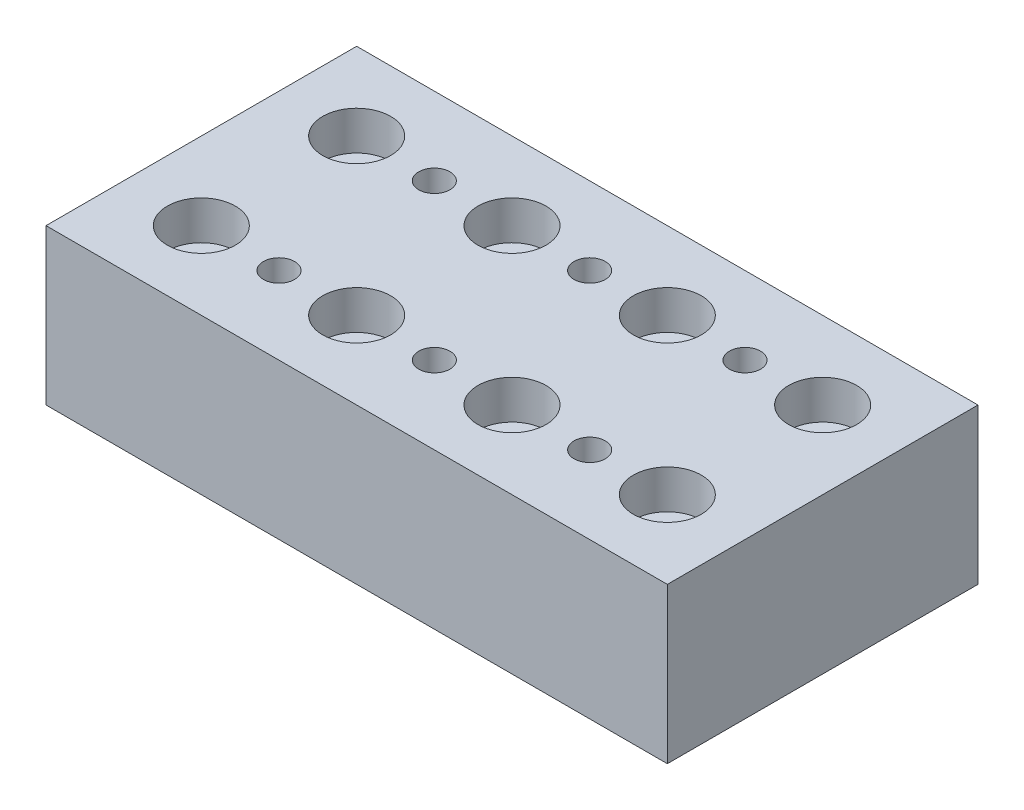
ISO-10303-21;
HEADER;
FILE_DESCRIPTION(('STEP AP214'),'2;1');
FILE_NAME('part.step','',(''),(''),'','','');
FILE_SCHEMA(('AUTOMOTIVE_DESIGN { 1 0 10303 214 1 1 1 1 }'));
ENDSEC;
DATA;
#1=APPLICATION_CONTEXT('core data for automotive mechanical design processes');
#2=APPLICATION_PROTOCOL_DEFINITION('international standard','automotive_design',2000,#1);
#3=PRODUCT_CONTEXT('',#1,'mechanical');
#4=PRODUCT('Part','Part','',(#3));
#5=PRODUCT_RELATED_PRODUCT_CATEGORY('part','',(#4));
#6=PRODUCT_DEFINITION_FORMATION('','',#4);
#7=PRODUCT_DEFINITION_CONTEXT('part definition',#1,'design');
#8=PRODUCT_DEFINITION('design','',#6,#7);
#9=PRODUCT_DEFINITION_SHAPE('','',#8);
#10=(LENGTH_UNIT() NAMED_UNIT(*) SI_UNIT(.MILLI.,.METRE.));
#11=(NAMED_UNIT(*) PLANE_ANGLE_UNIT() SI_UNIT($,.RADIAN.));
#12=(NAMED_UNIT(*) SI_UNIT($,.STERADIAN.) SOLID_ANGLE_UNIT());
#13=UNCERTAINTY_MEASURE_WITH_UNIT(LENGTH_MEASURE(1.E-05),#10,'distance_accuracy_value','');
#14=(GEOMETRIC_REPRESENTATION_CONTEXT(3) GLOBAL_UNCERTAINTY_ASSIGNED_CONTEXT((#13)) GLOBAL_UNIT_ASSIGNED_CONTEXT((#10,
#11,#12)) REPRESENTATION_CONTEXT('',''));
#15=CARTESIAN_POINT('',(0.,0.,0.));
#16=DIRECTION('',(0.,0.,1.));
#17=DIRECTION('',(1.,0.,0.));
#18=AXIS2_PLACEMENT_3D('',#15,#16,#17);
#19=CARTESIAN_POINT('',(0.,0.,-50.8));
#20=DIRECTION('',(0.,-1.,0.));
#21=DIRECTION('',(0.,0.,-1.));
#22=AXIS2_PLACEMENT_3D('',#19,#20,#21);
#23=PLANE('',#22);
#24=CARTESIAN_POINT('',(50.8,0.,-12.7));
#25=DIRECTION('',(0.,1.,0.));
#26=DIRECTION('',(0.,0.,1.));
#27=AXIS2_PLACEMENT_3D('',#24,#25,#26);
#28=CIRCLE('',#27,2.55269999999999);
#29=CARTESIAN_POINT('',(50.8,0.,-10.1473));
#30=VERTEX_POINT('',#29);
#31=EDGE_CURVE('E294',#30,#30,#28,.T.);
#32=ORIENTED_EDGE('',*,*,#31,.T.);
#33=EDGE_LOOP('',(#32));
#34=FACE_BOUND('',#33,.T.);
#35=CARTESIAN_POINT('',(76.2,0.,-38.1));
#36=DIRECTION('',(0.,1.,0.));
#37=DIRECTION('',(0.,0.,1.));
#38=AXIS2_PLACEMENT_3D('',#35,#36,#37);
#39=CIRCLE('',#38,2.55269999999999);
#40=CARTESIAN_POINT('',(76.2,0.,-35.5473));
#41=VERTEX_POINT('',#40);
#42=EDGE_CURVE('E307',#41,#41,#39,.T.);
#43=ORIENTED_EDGE('',*,*,#42,.T.);
#44=EDGE_LOOP('',(#43));
#45=FACE_BOUND('',#44,.T.);
#46=CARTESIAN_POINT('',(88.9,0.,-38.1));
#47=DIRECTION('',(0.,1.,0.));
#48=DIRECTION('',(0.,0.,1.));
#49=AXIS2_PLACEMENT_3D('',#46,#47,#48);
#50=CIRCLE('',#49,3.37819999999999);
#51=CARTESIAN_POINT('',(88.9,0.,-34.7218));
#52=VERTEX_POINT('',#51);
#53=EDGE_CURVE('E175',#52,#52,#50,.T.);
#54=ORIENTED_EDGE('',*,*,#53,.T.);
#55=EDGE_LOOP('',(#54));
#56=FACE_BOUND('',#55,.T.);
#57=CARTESIAN_POINT('',(88.9,0.,-12.7));
#58=DIRECTION('',(0.,1.,0.));
#59=DIRECTION('',(0.,0.,1.));
#60=AXIS2_PLACEMENT_3D('',#57,#58,#59);
#61=CIRCLE('',#60,3.37819999999999);
#62=CARTESIAN_POINT('',(88.9,0.,-9.3218));
#63=VERTEX_POINT('',#62);
#64=EDGE_CURVE('E163',#63,#63,#61,.T.);
#65=ORIENTED_EDGE('',*,*,#64,.T.);
#66=EDGE_LOOP('',(#65));
#67=FACE_BOUND('',#66,.T.);
#68=CARTESIAN_POINT('',(63.5,0.,-38.1));
#69=DIRECTION('',(0.,1.,0.));
#70=DIRECTION('',(0.,0.,1.));
#71=AXIS2_PLACEMENT_3D('',#68,#69,#70);
#72=CIRCLE('',#71,3.37819999999999);
#73=CARTESIAN_POINT('',(63.5,0.,-34.7218));
#74=VERTEX_POINT('',#73);
#75=EDGE_CURVE('E151',#74,#74,#72,.T.);
#76=ORIENTED_EDGE('',*,*,#75,.T.);
#77=EDGE_LOOP('',(#76));
#78=FACE_BOUND('',#77,.T.);
#79=CARTESIAN_POINT('',(63.5,0.,-12.7));
#80=DIRECTION('',(0.,1.,0.));
#81=DIRECTION('',(0.,0.,1.));
#82=AXIS2_PLACEMENT_3D('',#79,#80,#81);
#83=CIRCLE('',#82,3.37819999999999);
#84=CARTESIAN_POINT('',(63.5,0.,-9.3218));
#85=VERTEX_POINT('',#84);
#86=EDGE_CURVE('E139',#85,#85,#83,.T.);
#87=ORIENTED_EDGE('',*,*,#86,.T.);
#88=EDGE_LOOP('',(#87));
#89=FACE_BOUND('',#88,.T.);
#90=CARTESIAN_POINT('',(38.1,0.,-38.1));
#91=DIRECTION('',(0.,1.,0.));
#92=DIRECTION('',(0.,0.,1.));
#93=AXIS2_PLACEMENT_3D('',#90,#91,#92);
#94=CIRCLE('',#93,3.37819999999999);
#95=CARTESIAN_POINT('',(38.1,0.,-34.7218));
#96=VERTEX_POINT('',#95);
#97=EDGE_CURVE('E127',#96,#96,#94,.T.);
#98=ORIENTED_EDGE('',*,*,#97,.T.);
#99=EDGE_LOOP('',(#98));
#100=FACE_BOUND('',#99,.T.);
#101=CARTESIAN_POINT('',(38.1,0.,-12.7));
#102=DIRECTION('',(0.,1.,0.));
#103=DIRECTION('',(0.,0.,1.));
#104=AXIS2_PLACEMENT_3D('',#101,#102,#103);
#105=CIRCLE('',#104,3.37819999999999);
#106=CARTESIAN_POINT('',(38.1,0.,-9.3218));
#107=VERTEX_POINT('',#106);
#108=EDGE_CURVE('E115',#107,#107,#105,.T.);
#109=ORIENTED_EDGE('',*,*,#108,.T.);
#110=EDGE_LOOP('',(#109));
#111=FACE_BOUND('',#110,.T.);
#112=DIRECTION('',(0.,0.,1.));
#113=VECTOR('',#112,1.);
#114=CARTESIAN_POINT('',(0.,0.,0.));
#115=LINE('',#114,#113);
#116=CARTESIAN_POINT('',(0.,0.,-50.8));
#117=VERTEX_POINT('',#116);
#118=CARTESIAN_POINT('',(0.,0.,0.));
#119=VERTEX_POINT('',#118);
#120=EDGE_CURVE('E102',#117,#119,#115,.T.);
#121=ORIENTED_EDGE('',*,*,#120,.F.);
#122=DIRECTION('',(-1.,0.,0.));
#123=VECTOR('',#122,1.);
#124=CARTESIAN_POINT('',(0.,0.,-50.8));
#125=LINE('',#124,#123);
#126=CARTESIAN_POINT('',(101.6,0.,-50.8));
#127=VERTEX_POINT('',#126);
#128=EDGE_CURVE('E73',#127,#117,#125,.T.);
#129=ORIENTED_EDGE('',*,*,#128,.F.);
#130=DIRECTION('',(0.,0.,-1.));
#131=VECTOR('',#130,1.);
#132=CARTESIAN_POINT('',(101.6,0.,0.));
#133=LINE('',#132,#131);
#134=CARTESIAN_POINT('',(101.6,0.,0.));
#135=VERTEX_POINT('',#134);
#136=EDGE_CURVE('E67',#135,#127,#133,.T.);
#137=ORIENTED_EDGE('',*,*,#136,.F.);
#138=DIRECTION('',(1.,0.,0.));
#139=VECTOR('',#138,1.);
#140=CARTESIAN_POINT('',(0.,0.,0.));
#141=LINE('',#140,#139);
#142=EDGE_CURVE('E92',#119,#135,#141,.T.);
#143=ORIENTED_EDGE('',*,*,#142,.F.);
#144=EDGE_LOOP('',(#121,#129,#137,#143));
#145=FACE_BOUND('',#144,.T.);
#146=CARTESIAN_POINT('',(12.7,0.,-12.7));
#147=DIRECTION('',(0.,1.,0.));
#148=DIRECTION('',(0.,0.,1.));
#149=AXIS2_PLACEMENT_3D('',#146,#147,#148);
#150=CIRCLE('',#149,3.37819999999999);
#151=CARTESIAN_POINT('',(12.7,0.,-9.3218));
#152=VERTEX_POINT('',#151);
#153=EDGE_CURVE('E105',#152,#152,#150,.T.);
#154=ORIENTED_EDGE('',*,*,#153,.T.);
#155=EDGE_LOOP('',(#154));
#156=FACE_BOUND('',#155,.T.);
#157=CARTESIAN_POINT('',(12.7,0.,-38.1));
#158=DIRECTION('',(0.,1.,0.));
#159=DIRECTION('',(0.,0.,1.));
#160=AXIS2_PLACEMENT_3D('',#157,#158,#159);
#161=CIRCLE('',#160,3.37819999999999);
#162=CARTESIAN_POINT('',(12.7,0.,-34.7218));
#163=VERTEX_POINT('',#162);
#164=EDGE_CURVE('E273',#163,#163,#161,.T.);
#165=ORIENTED_EDGE('',*,*,#164,.T.);
#166=EDGE_LOOP('',(#165));
#167=FACE_BOUND('',#166,.T.);
#168=CARTESIAN_POINT('',(25.4,0.,-38.1));
#169=DIRECTION('',(0.,1.,0.));
#170=DIRECTION('',(0.,0.,1.));
#171=AXIS2_PLACEMENT_3D('',#168,#169,#170);
#172=CIRCLE('',#171,2.55269999999999);
#173=CARTESIAN_POINT('',(25.4,0.,-35.5473));
#174=VERTEX_POINT('',#173);
#175=EDGE_CURVE('E277',#174,#174,#172,.T.);
#176=ORIENTED_EDGE('',*,*,#175,.T.);
#177=EDGE_LOOP('',(#176));
#178=FACE_BOUND('',#177,.T.);
#179=CARTESIAN_POINT('',(50.8,0.,-38.1));
#180=DIRECTION('',(0.,1.,0.));
#181=DIRECTION('',(0.,0.,1.));
#182=AXIS2_PLACEMENT_3D('',#179,#180,#181);
#183=CIRCLE('',#182,2.55269999999999);
#184=CARTESIAN_POINT('',(50.8,0.,-35.5473));
#185=VERTEX_POINT('',#184);
#186=EDGE_CURVE('E281',#185,#185,#183,.T.);
#187=ORIENTED_EDGE('',*,*,#186,.T.);
#188=EDGE_LOOP('',(#187));
#189=FACE_BOUND('',#188,.T.);
#190=CARTESIAN_POINT('',(25.4,0.,-12.7));
#191=DIRECTION('',(0.,1.,0.));
#192=DIRECTION('',(0.,0.,1.));
#193=AXIS2_PLACEMENT_3D('',#190,#191,#192);
#194=CIRCLE('',#193,2.55269999999999);
#195=CARTESIAN_POINT('',(25.4,0.,-10.1473));
#196=VERTEX_POINT('',#195);
#197=EDGE_CURVE('E285',#196,#196,#194,.T.);
#198=ORIENTED_EDGE('',*,*,#197,.T.);
#199=EDGE_LOOP('',(#198));
#200=FACE_BOUND('',#199,.T.);
#201=CARTESIAN_POINT('',(76.2,0.,-12.7));
#202=DIRECTION('',(0.,1.,0.));
#203=DIRECTION('',(0.,0.,1.));
#204=AXIS2_PLACEMENT_3D('',#201,#202,#203);
#205=CIRCLE('',#204,2.55269999999999);
#206=CARTESIAN_POINT('',(76.2,0.,-10.1473));
#207=VERTEX_POINT('',#206);
#208=EDGE_CURVE('E288',#207,#207,#205,.T.);
#209=ORIENTED_EDGE('',*,*,#208,.T.);
#210=EDGE_LOOP('',(#209));
#211=FACE_BOUND('',#210,.T.);
#212=ADVANCED_FACE('F33',(#34,#45,#56,#67,#78,#89,#100,#111,#145,#156,#167,#178,#189,#200,#211),
#23,.T.);
#213=CARTESIAN_POINT('',(0.,25.4,-50.8));
#214=DIRECTION('',(0.,-1.,0.));
#215=DIRECTION('',(0.,0.,-1.));
#216=AXIS2_PLACEMENT_3D('',#213,#214,#215);
#217=PLANE('',#216);
#218=CARTESIAN_POINT('',(50.8,25.4,-12.7));
#219=DIRECTION('',(0.,1.,0.));
#220=DIRECTION('',(0.,0.,1.));
#221=AXIS2_PLACEMENT_3D('',#218,#219,#220);
#222=CIRCLE('',#221,2.55269999999999);
#223=CARTESIAN_POINT('',(50.8,25.4,-10.1473));
#224=VERTEX_POINT('',#223);
#225=EDGE_CURVE('E290',#224,#224,#222,.T.);
#226=ORIENTED_EDGE('',*,*,#225,.F.);
#227=EDGE_LOOP('',(#226));
#228=FACE_BOUND('',#227,.T.);
#229=CARTESIAN_POINT('',(76.2,25.4,-38.1));
#230=DIRECTION('',(0.,1.,0.));
#231=DIRECTION('',(0.,0.,1.));
#232=AXIS2_PLACEMENT_3D('',#229,#230,#231);
#233=CIRCLE('',#232,2.55269999999999);
#234=CARTESIAN_POINT('',(76.2,25.4,-35.5473));
#235=VERTEX_POINT('',#234);
#236=EDGE_CURVE('E304',#235,#235,#233,.T.);
#237=ORIENTED_EDGE('',*,*,#236,.F.);
#238=EDGE_LOOP('',(#237));
#239=FACE_BOUND('',#238,.T.);
#240=CARTESIAN_POINT('',(88.9,25.4,-38.1));
#241=DIRECTION('',(0.,1.,0.));
#242=DIRECTION('',(0.,0.,1.));
#243=AXIS2_PLACEMENT_3D('',#240,#241,#242);
#244=CIRCLE('',#243,5.55625);
#245=CARTESIAN_POINT('',(88.9,25.4,-32.54375));
#246=VERTEX_POINT('',#245);
#247=EDGE_CURVE('E172',#246,#246,#244,.T.);
#248=ORIENTED_EDGE('',*,*,#247,.F.);
#249=EDGE_LOOP('',(#248));
#250=FACE_BOUND('',#249,.T.);
#251=CARTESIAN_POINT('',(88.9,25.4,-12.7));
#252=DIRECTION('',(0.,1.,0.));
#253=DIRECTION('',(0.,0.,1.));
#254=AXIS2_PLACEMENT_3D('',#251,#252,#253);
#255=CIRCLE('',#254,5.55625);
#256=CARTESIAN_POINT('',(88.9,25.4,-7.14374999999999));
#257=VERTEX_POINT('',#256);
#258=EDGE_CURVE('E160',#257,#257,#255,.T.);
#259=ORIENTED_EDGE('',*,*,#258,.F.);
#260=EDGE_LOOP('',(#259));
#261=FACE_BOUND('',#260,.T.);
#262=CARTESIAN_POINT('',(63.5,25.4,-38.1));
#263=DIRECTION('',(0.,1.,0.));
#264=DIRECTION('',(0.,0.,1.));
#265=AXIS2_PLACEMENT_3D('',#262,#263,#264);
#266=CIRCLE('',#265,5.55625);
#267=CARTESIAN_POINT('',(63.5,25.4,-32.54375));
#268=VERTEX_POINT('',#267);
#269=EDGE_CURVE('E148',#268,#268,#266,.T.);
#270=ORIENTED_EDGE('',*,*,#269,.F.);
#271=EDGE_LOOP('',(#270));
#272=FACE_BOUND('',#271,.T.);
#273=CARTESIAN_POINT('',(63.5,25.4,-12.7));
#274=DIRECTION('',(0.,1.,0.));
#275=DIRECTION('',(0.,0.,1.));
#276=AXIS2_PLACEMENT_3D('',#273,#274,#275);
#277=CIRCLE('',#276,5.55625);
#278=CARTESIAN_POINT('',(63.5,25.4,-7.14374999999999));
#279=VERTEX_POINT('',#278);
#280=EDGE_CURVE('E136',#279,#279,#277,.T.);
#281=ORIENTED_EDGE('',*,*,#280,.F.);
#282=EDGE_LOOP('',(#281));
#283=FACE_BOUND('',#282,.T.);
#284=CARTESIAN_POINT('',(38.1,25.4,-38.1));
#285=DIRECTION('',(0.,1.,0.));
#286=DIRECTION('',(0.,0.,1.));
#287=AXIS2_PLACEMENT_3D('',#284,#285,#286);
#288=CIRCLE('',#287,5.55625);
#289=CARTESIAN_POINT('',(38.1,25.4,-32.54375));
#290=VERTEX_POINT('',#289);
#291=EDGE_CURVE('E124',#290,#290,#288,.T.);
#292=ORIENTED_EDGE('',*,*,#291,.F.);
#293=EDGE_LOOP('',(#292));
#294=FACE_BOUND('',#293,.T.);
#295=CARTESIAN_POINT('',(38.1,25.4,-12.7));
#296=DIRECTION('',(0.,1.,0.));
#297=DIRECTION('',(0.,0.,1.));
#298=AXIS2_PLACEMENT_3D('',#295,#296,#297);
#299=CIRCLE('',#298,5.55625);
#300=CARTESIAN_POINT('',(38.1,25.4,-7.14374999999999));
#301=VERTEX_POINT('',#300);
#302=EDGE_CURVE('E112',#301,#301,#299,.T.);
#303=ORIENTED_EDGE('',*,*,#302,.F.);
#304=EDGE_LOOP('',(#303));
#305=FACE_BOUND('',#304,.T.);
#306=DIRECTION('',(0.,0.,1.));
#307=VECTOR('',#306,1.);
#308=CARTESIAN_POINT('',(0.,25.4,0.));
#309=LINE('',#308,#307);
#310=CARTESIAN_POINT('',(0.,25.4,-50.8));
#311=VERTEX_POINT('',#310);
#312=CARTESIAN_POINT('',(0.,25.4,0.));
#313=VERTEX_POINT('',#312);
#314=EDGE_CURVE('E87',#311,#313,#309,.T.);
#315=ORIENTED_EDGE('',*,*,#314,.T.);
#316=DIRECTION('',(1.,0.,0.));
#317=VECTOR('',#316,1.);
#318=CARTESIAN_POINT('',(0.,25.4,0.));
#319=LINE('',#318,#317);
#320=CARTESIAN_POINT('',(101.6,25.4,0.));
#321=VERTEX_POINT('',#320);
#322=EDGE_CURVE('E81',#313,#321,#319,.T.);
#323=ORIENTED_EDGE('',*,*,#322,.T.);
#324=DIRECTION('',(0.,0.,-1.));
#325=VECTOR('',#324,1.);
#326=CARTESIAN_POINT('',(101.6,25.4,0.));
#327=LINE('',#326,#325);
#328=CARTESIAN_POINT('',(101.6,25.4,-50.8));
#329=VERTEX_POINT('',#328);
#330=EDGE_CURVE('E85',#321,#329,#327,.T.);
#331=ORIENTED_EDGE('',*,*,#330,.T.);
#332=DIRECTION('',(-1.,0.,0.));
#333=VECTOR('',#332,1.);
#334=CARTESIAN_POINT('',(0.,25.4,-50.8));
#335=LINE('',#334,#333);
#336=EDGE_CURVE('E50',#329,#311,#335,.T.);
#337=ORIENTED_EDGE('',*,*,#336,.T.);
#338=EDGE_LOOP('',(#315,#323,#331,#337));
#339=FACE_BOUND('',#338,.T.);
#340=CARTESIAN_POINT('',(12.7,25.4,-12.7));
#341=DIRECTION('',(0.,1.,0.));
#342=DIRECTION('',(0.,0.,1.));
#343=AXIS2_PLACEMENT_3D('',#340,#341,#342);
#344=CIRCLE('',#343,5.55625);
#345=CARTESIAN_POINT('',(12.7,25.4,-7.14375));
#346=VERTEX_POINT('',#345);
#347=EDGE_CURVE('E328',#346,#346,#344,.T.);
#348=ORIENTED_EDGE('',*,*,#347,.F.);
#349=EDGE_LOOP('',(#348));
#350=FACE_BOUND('',#349,.T.);
#351=CARTESIAN_POINT('',(12.7,25.4,-38.1));
#352=DIRECTION('',(0.,1.,0.));
#353=DIRECTION('',(0.,0.,1.));
#354=AXIS2_PLACEMENT_3D('',#351,#352,#353);
#355=CIRCLE('',#354,5.55625);
#356=CARTESIAN_POINT('',(12.7,25.4,-32.54375));
#357=VERTEX_POINT('',#356);
#358=EDGE_CURVE('E318',#357,#357,#355,.T.);
#359=ORIENTED_EDGE('',*,*,#358,.F.);
#360=EDGE_LOOP('',(#359));
#361=FACE_BOUND('',#360,.T.);
#362=CARTESIAN_POINT('',(25.4,25.4,-38.1));
#363=DIRECTION('',(0.,1.,0.));
#364=DIRECTION('',(0.,0.,1.));
#365=AXIS2_PLACEMENT_3D('',#362,#363,#364);
#366=CIRCLE('',#365,2.55269999999999);
#367=CARTESIAN_POINT('',(25.4,25.4,-35.5473));
#368=VERTEX_POINT('',#367);
#369=EDGE_CURVE('E314',#368,#368,#366,.T.);
#370=ORIENTED_EDGE('',*,*,#369,.F.);
#371=EDGE_LOOP('',(#370));
#372=FACE_BOUND('',#371,.T.);
#373=CARTESIAN_POINT('',(50.8,25.4,-38.1));
#374=DIRECTION('',(0.,1.,0.));
#375=DIRECTION('',(0.,0.,1.));
#376=AXIS2_PLACEMENT_3D('',#373,#374,#375);
#377=CIRCLE('',#376,2.55269999999999);
#378=CARTESIAN_POINT('',(50.8,25.4,-35.5473));
#379=VERTEX_POINT('',#378);
#380=EDGE_CURVE('E310',#379,#379,#377,.T.);
#381=ORIENTED_EDGE('',*,*,#380,.F.);
#382=EDGE_LOOP('',(#381));
#383=FACE_BOUND('',#382,.T.);
#384=CARTESIAN_POINT('',(25.4,25.4,-12.7));
#385=DIRECTION('',(0.,1.,0.));
#386=DIRECTION('',(0.,0.,1.));
#387=AXIS2_PLACEMENT_3D('',#384,#385,#386);
#388=CIRCLE('',#387,2.55269999999999);
#389=CARTESIAN_POINT('',(25.4,25.4,-10.1473));
#390=VERTEX_POINT('',#389);
#391=EDGE_CURVE('E300',#390,#390,#388,.T.);
#392=ORIENTED_EDGE('',*,*,#391,.F.);
#393=EDGE_LOOP('',(#392));
#394=FACE_BOUND('',#393,.T.);
#395=CARTESIAN_POINT('',(76.2,25.4,-12.7));
#396=DIRECTION('',(0.,1.,0.));
#397=DIRECTION('',(0.,0.,1.));
#398=AXIS2_PLACEMENT_3D('',#395,#396,#397);
#399=CIRCLE('',#398,2.55269999999999);
#400=CARTESIAN_POINT('',(76.2,25.4,-10.1473));
#401=VERTEX_POINT('',#400);
#402=EDGE_CURVE('E291',#401,#401,#399,.T.);
#403=ORIENTED_EDGE('',*,*,#402,.F.);
#404=EDGE_LOOP('',(#403));
#405=FACE_BOUND('',#404,.T.);
#406=ADVANCED_FACE('F82',(#228,#239,#250,#261,#272,#283,#294,#305,#339,#350,#361,#372,#383,#394,
#405),#217,.F.);
#407=CARTESIAN_POINT('',(0.,25.4,0.));
#408=DIRECTION('',(1.,0.,0.));
#409=DIRECTION('',(0.,0.,-1.));
#410=AXIS2_PLACEMENT_3D('',#407,#408,#409);
#411=PLANE('',#410);
#412=ORIENTED_EDGE('',*,*,#120,.T.);
#413=DIRECTION('',(0.,-1.,0.));
#414=VECTOR('',#413,1.);
#415=CARTESIAN_POINT('',(0.,25.4,0.));
#416=LINE('',#415,#414);
#417=EDGE_CURVE('E93',#313,#119,#416,.T.);
#418=ORIENTED_EDGE('',*,*,#417,.F.);
#419=ORIENTED_EDGE('',*,*,#314,.F.);
#420=DIRECTION('',(0.,-1.,0.));
#421=VECTOR('',#420,1.);
#422=CARTESIAN_POINT('',(0.,25.4,-50.8));
#423=LINE('',#422,#421);
#424=EDGE_CURVE('E98',#311,#117,#423,.T.);
#425=ORIENTED_EDGE('',*,*,#424,.T.);
#426=EDGE_LOOP('',(#412,#418,#419,#425));
#427=FACE_BOUND('',#426,.T.);
#428=ADVANCED_FACE('F194',(#427),#411,.F.);
#429=CARTESIAN_POINT('',(0.,25.4,0.));
#430=DIRECTION('',(0.,0.,-1.));
#431=DIRECTION('',(-1.,0.,0.));
#432=AXIS2_PLACEMENT_3D('',#429,#430,#431);
#433=PLANE('',#432);
#434=ORIENTED_EDGE('',*,*,#142,.T.);
#435=DIRECTION('',(0.,-1.,0.));
#436=VECTOR('',#435,1.);
#437=CARTESIAN_POINT('',(101.6,25.4,0.));
#438=LINE('',#437,#436);
#439=EDGE_CURVE('E90',#321,#135,#438,.T.);
#440=ORIENTED_EDGE('',*,*,#439,.F.);
#441=ORIENTED_EDGE('',*,*,#322,.F.);
#442=ORIENTED_EDGE('',*,*,#417,.T.);
#443=EDGE_LOOP('',(#434,#440,#441,#442));
#444=FACE_BOUND('',#443,.T.);
#445=ADVANCED_FACE('F91',(#444),#433,.F.);
#446=CARTESIAN_POINT('',(101.6,25.4,0.));
#447=DIRECTION('',(-1.,0.,0.));
#448=DIRECTION('',(0.,0.,1.));
#449=AXIS2_PLACEMENT_3D('',#446,#447,#448);
#450=PLANE('',#449);
#451=ORIENTED_EDGE('',*,*,#136,.T.);
#452=DIRECTION('',(0.,-1.,0.));
#453=VECTOR('',#452,1.);
#454=CARTESIAN_POINT('',(101.6,25.4,-50.8));
#455=LINE('',#454,#453);
#456=EDGE_CURVE('E94',#329,#127,#455,.T.);
#457=ORIENTED_EDGE('',*,*,#456,.F.);
#458=ORIENTED_EDGE('',*,*,#330,.F.);
#459=ORIENTED_EDGE('',*,*,#439,.T.);
#460=EDGE_LOOP('',(#451,#457,#458,#459));
#461=FACE_BOUND('',#460,.T.);
#462=ADVANCED_FACE('F96',(#461),#450,.F.);
#463=CARTESIAN_POINT('',(0.,25.4,-50.8));
#464=DIRECTION('',(0.,0.,1.));
#465=DIRECTION('',(1.,0.,0.));
#466=AXIS2_PLACEMENT_3D('',#463,#464,#465);
#467=PLANE('',#466);
#468=ORIENTED_EDGE('',*,*,#128,.T.);
#469=ORIENTED_EDGE('',*,*,#424,.F.);
#470=ORIENTED_EDGE('',*,*,#336,.F.);
#471=ORIENTED_EDGE('',*,*,#456,.T.);
#472=EDGE_LOOP('',(#468,#469,#470,#471));
#473=FACE_BOUND('',#472,.T.);
#474=ADVANCED_FACE('F239',(#473),#467,.F.);
#475=CARTESIAN_POINT('',(12.7,25.4,-12.7));
#476=DIRECTION('',(0.,1.,0.));
#477=DIRECTION('',(0.,0.,1.));
#478=AXIS2_PLACEMENT_3D('',#475,#476,#477);
#479=CYLINDRICAL_SURFACE('',#478,3.3782);
#480=ORIENTED_EDGE('',*,*,#153,.F.);
#481=EDGE_LOOP('',(#480));
#482=FACE_BOUND('',#481,.T.);
#483=CARTESIAN_POINT('',(12.7,19.05,-12.7));
#484=DIRECTION('',(0.,1.,0.));
#485=DIRECTION('',(0.,0.,1.));
#486=AXIS2_PLACEMENT_3D('',#483,#484,#485);
#487=CIRCLE('',#486,3.3782);
#488=CARTESIAN_POINT('',(12.7,19.05,-9.3218));
#489=VERTEX_POINT('',#488);
#490=EDGE_CURVE('E334',#489,#489,#487,.T.);
#491=ORIENTED_EDGE('',*,*,#490,.T.);
#492=EDGE_LOOP('',(#491));
#493=FACE_BOUND('',#492,.T.);
#494=ADVANCED_FACE('F242',(#482,#493),#479,.F.);
#495=CARTESIAN_POINT('',(16.0782,19.05,-12.7));
#496=DIRECTION('',(0.,-1.,0.));
#497=DIRECTION('',(0.,0.,-1.));
#498=AXIS2_PLACEMENT_3D('',#495,#496,#497);
#499=PLANE('',#498);
#500=ORIENTED_EDGE('',*,*,#490,.F.);
#501=EDGE_LOOP('',(#500));
#502=FACE_BOUND('',#501,.T.);
#503=CARTESIAN_POINT('',(12.7,19.05,-12.7));
#504=DIRECTION('',(0.,1.,0.));
#505=DIRECTION('',(0.,0.,1.));
#506=AXIS2_PLACEMENT_3D('',#503,#504,#505);
#507=CIRCLE('',#506,5.55625);
#508=CARTESIAN_POINT('',(12.7,19.05,-7.14375));
#509=VERTEX_POINT('',#508);
#510=EDGE_CURVE('E331',#509,#509,#507,.T.);
#511=ORIENTED_EDGE('',*,*,#510,.T.);
#512=EDGE_LOOP('',(#511));
#513=FACE_BOUND('',#512,.T.);
#514=ADVANCED_FACE('F340',(#502,#513),#499,.F.);
#515=CARTESIAN_POINT('',(12.7,25.4,-12.7));
#516=DIRECTION('',(0.,1.,0.));
#517=DIRECTION('',(0.,0.,1.));
#518=AXIS2_PLACEMENT_3D('',#515,#516,#517);
#519=CYLINDRICAL_SURFACE('',#518,5.55625);
#520=ORIENTED_EDGE('',*,*,#510,.F.);
#521=EDGE_LOOP('',(#520));
#522=FACE_BOUND('',#521,.T.);
#523=ORIENTED_EDGE('',*,*,#347,.T.);
#524=EDGE_LOOP('',(#523));
#525=FACE_BOUND('',#524,.T.);
#526=ADVANCED_FACE('F224',(#522,#525),#519,.F.);
#527=CARTESIAN_POINT('',(12.7,25.4,-38.1));
#528=DIRECTION('',(0.,1.,0.));
#529=DIRECTION('',(0.,0.,1.));
#530=AXIS2_PLACEMENT_3D('',#527,#528,#529);
#531=CYLINDRICAL_SURFACE('',#530,3.3782);
#532=ORIENTED_EDGE('',*,*,#164,.F.);
#533=EDGE_LOOP('',(#532));
#534=FACE_BOUND('',#533,.T.);
#535=CARTESIAN_POINT('',(12.7,19.05,-38.1));
#536=DIRECTION('',(0.,1.,0.));
#537=DIRECTION('',(0.,0.,1.));
#538=AXIS2_PLACEMENT_3D('',#535,#536,#537);
#539=CIRCLE('',#538,3.3782);
#540=CARTESIAN_POINT('',(12.7,19.05,-34.7218));
#541=VERTEX_POINT('',#540);
#542=EDGE_CURVE('E325',#541,#541,#539,.T.);
#543=ORIENTED_EDGE('',*,*,#542,.T.);
#544=EDGE_LOOP('',(#543));
#545=FACE_BOUND('',#544,.T.);
#546=ADVANCED_FACE('F213',(#534,#545),#531,.F.);
#547=CARTESIAN_POINT('',(16.0782,19.05,-38.1));
#548=DIRECTION('',(0.,-1.,0.));
#549=DIRECTION('',(0.,0.,-1.));
#550=AXIS2_PLACEMENT_3D('',#547,#548,#549);
#551=PLANE('',#550);
#552=ORIENTED_EDGE('',*,*,#542,.F.);
#553=EDGE_LOOP('',(#552));
#554=FACE_BOUND('',#553,.T.);
#555=CARTESIAN_POINT('',(12.7,19.05,-38.1));
#556=DIRECTION('',(0.,1.,0.));
#557=DIRECTION('',(0.,0.,1.));
#558=AXIS2_PLACEMENT_3D('',#555,#556,#557);
#559=CIRCLE('',#558,5.55625);
#560=CARTESIAN_POINT('',(12.7,19.05,-32.54375));
#561=VERTEX_POINT('',#560);
#562=EDGE_CURVE('E322',#561,#561,#559,.T.);
#563=ORIENTED_EDGE('',*,*,#562,.T.);
#564=EDGE_LOOP('',(#563));
#565=FACE_BOUND('',#564,.T.);
#566=ADVANCED_FACE('F221',(#554,#565),#551,.F.);
#567=CARTESIAN_POINT('',(12.7,25.4,-38.1));
#568=DIRECTION('',(0.,1.,0.));
#569=DIRECTION('',(0.,0.,1.));
#570=AXIS2_PLACEMENT_3D('',#567,#568,#569);
#571=CYLINDRICAL_SURFACE('',#570,5.55625);
#572=ORIENTED_EDGE('',*,*,#562,.F.);
#573=EDGE_LOOP('',(#572));
#574=FACE_BOUND('',#573,.T.);
#575=ORIENTED_EDGE('',*,*,#358,.T.);
#576=EDGE_LOOP('',(#575));
#577=FACE_BOUND('',#576,.T.);
#578=ADVANCED_FACE('F210',(#574,#577),#571,.F.);
#579=CARTESIAN_POINT('',(38.1,25.4,-12.7));
#580=DIRECTION('',(0.,1.,0.));
#581=DIRECTION('',(0.,0.,1.));
#582=AXIS2_PLACEMENT_3D('',#579,#580,#581);
#583=CYLINDRICAL_SURFACE('',#582,5.55625);
#584=CARTESIAN_POINT('',(38.1,19.05,-12.7));
#585=DIRECTION('',(0.,1.,0.));
#586=DIRECTION('',(0.,0.,1.));
#587=AXIS2_PLACEMENT_3D('',#584,#585,#586);
#588=CIRCLE('',#587,5.55625);
#589=CARTESIAN_POINT('',(38.1,19.05,-7.14375));
#590=VERTEX_POINT('',#589);
#591=EDGE_CURVE('E121',#590,#590,#588,.T.);
#592=ORIENTED_EDGE('',*,*,#591,.F.);
#593=EDGE_LOOP('',(#592));
#594=FACE_BOUND('',#593,.T.);
#595=ORIENTED_EDGE('',*,*,#302,.T.);
#596=EDGE_LOOP('',(#595));
#597=FACE_BOUND('',#596,.T.);
#598=ADVANCED_FACE('F207',(#594,#597),#583,.F.);
#599=CARTESIAN_POINT('',(41.4782,19.05,-12.7));
#600=DIRECTION('',(0.,-1.,0.));
#601=DIRECTION('',(0.,0.,-1.));
#602=AXIS2_PLACEMENT_3D('',#599,#600,#601);
#603=PLANE('',#602);
#604=CARTESIAN_POINT('',(38.1,19.05,-12.7));
#605=DIRECTION('',(0.,1.,0.));
#606=DIRECTION('',(0.,0.,1.));
#607=AXIS2_PLACEMENT_3D('',#604,#605,#606);
#608=CIRCLE('',#607,3.3782);
#609=CARTESIAN_POINT('',(38.1,19.05,-9.32179999999999));
#610=VERTEX_POINT('',#609);
#611=EDGE_CURVE('E118',#610,#610,#608,.T.);
#612=ORIENTED_EDGE('',*,*,#611,.F.);
#613=EDGE_LOOP('',(#612));
#614=FACE_BOUND('',#613,.T.);
#615=ORIENTED_EDGE('',*,*,#591,.T.);
#616=EDGE_LOOP('',(#615));
#617=FACE_BOUND('',#616,.T.);
#618=ADVANCED_FACE('F209',(#614,#617),#603,.F.);
#619=CARTESIAN_POINT('',(38.1,25.4,-12.7));
#620=DIRECTION('',(0.,1.,0.));
#621=DIRECTION('',(0.,0.,1.));
#622=AXIS2_PLACEMENT_3D('',#619,#620,#621);
#623=CYLINDRICAL_SURFACE('',#622,3.3782);
#624=ORIENTED_EDGE('',*,*,#108,.F.);
#625=EDGE_LOOP('',(#624));
#626=FACE_BOUND('',#625,.T.);
#627=ORIENTED_EDGE('',*,*,#611,.T.);
#628=EDGE_LOOP('',(#627));
#629=FACE_BOUND('',#628,.T.);
#630=ADVANCED_FACE('F218',(#626,#629),#623,.F.);
#631=CARTESIAN_POINT('',(38.1,25.4,-38.1));
#632=DIRECTION('',(0.,1.,0.));
#633=DIRECTION('',(0.,0.,1.));
#634=AXIS2_PLACEMENT_3D('',#631,#632,#633);
#635=CYLINDRICAL_SURFACE('',#634,5.55625);
#636=CARTESIAN_POINT('',(38.1,19.05,-38.1));
#637=DIRECTION('',(0.,1.,0.));
#638=DIRECTION('',(0.,0.,1.));
#639=AXIS2_PLACEMENT_3D('',#636,#637,#638);
#640=CIRCLE('',#639,5.55625);
#641=CARTESIAN_POINT('',(38.1,19.05,-32.54375));
#642=VERTEX_POINT('',#641);
#643=EDGE_CURVE('E133',#642,#642,#640,.T.);
#644=ORIENTED_EDGE('',*,*,#643,.F.);
#645=EDGE_LOOP('',(#644));
#646=FACE_BOUND('',#645,.T.);
#647=ORIENTED_EDGE('',*,*,#291,.T.);
#648=EDGE_LOOP('',(#647));
#649=FACE_BOUND('',#648,.T.);
#650=ADVANCED_FACE('F251',(#646,#649),#635,.F.);
#651=CARTESIAN_POINT('',(41.4782,19.05,-38.1));
#652=DIRECTION('',(0.,-1.,0.));
#653=DIRECTION('',(0.,0.,-1.));
#654=AXIS2_PLACEMENT_3D('',#651,#652,#653);
#655=PLANE('',#654);
#656=CARTESIAN_POINT('',(38.1,19.05,-38.1));
#657=DIRECTION('',(0.,1.,0.));
#658=DIRECTION('',(0.,0.,1.));
#659=AXIS2_PLACEMENT_3D('',#656,#657,#658);
#660=CIRCLE('',#659,3.3782);
#661=CARTESIAN_POINT('',(38.1,19.05,-34.7218));
#662=VERTEX_POINT('',#661);
#663=EDGE_CURVE('E130',#662,#662,#660,.T.);
#664=ORIENTED_EDGE('',*,*,#663,.F.);
#665=EDGE_LOOP('',(#664));
#666=FACE_BOUND('',#665,.T.);
#667=ORIENTED_EDGE('',*,*,#643,.T.);
#668=EDGE_LOOP('',(#667));
#669=FACE_BOUND('',#668,.T.);
#670=ADVANCED_FACE('F256',(#666,#669),#655,.F.);
#671=CARTESIAN_POINT('',(38.1,25.4,-38.1));
#672=DIRECTION('',(0.,1.,0.));
#673=DIRECTION('',(0.,0.,1.));
#674=AXIS2_PLACEMENT_3D('',#671,#672,#673);
#675=CYLINDRICAL_SURFACE('',#674,3.3782);
#676=ORIENTED_EDGE('',*,*,#97,.F.);
#677=EDGE_LOOP('',(#676));
#678=FACE_BOUND('',#677,.T.);
#679=ORIENTED_EDGE('',*,*,#663,.T.);
#680=EDGE_LOOP('',(#679));
#681=FACE_BOUND('',#680,.T.);
#682=ADVANCED_FACE('F444',(#678,#681),#675,.F.);
#683=CARTESIAN_POINT('',(63.5,25.4,-12.7));
#684=DIRECTION('',(0.,1.,0.));
#685=DIRECTION('',(0.,0.,1.));
#686=AXIS2_PLACEMENT_3D('',#683,#684,#685);
#687=CYLINDRICAL_SURFACE('',#686,5.55625);
#688=CARTESIAN_POINT('',(63.5,19.05,-12.7));
#689=DIRECTION('',(0.,1.,0.));
#690=DIRECTION('',(0.,0.,1.));
#691=AXIS2_PLACEMENT_3D('',#688,#689,#690);
#692=CIRCLE('',#691,5.55625);
#693=CARTESIAN_POINT('',(63.5,19.05,-7.14375));
#694=VERTEX_POINT('',#693);
#695=EDGE_CURVE('E145',#694,#694,#692,.T.);
#696=ORIENTED_EDGE('',*,*,#695,.F.);
#697=EDGE_LOOP('',(#696));
#698=FACE_BOUND('',#697,.T.);
#699=ORIENTED_EDGE('',*,*,#280,.T.);
#700=EDGE_LOOP('',(#699));
#701=FACE_BOUND('',#700,.T.);
#702=ADVANCED_FACE('F454',(#698,#701),#687,.F.);
#703=CARTESIAN_POINT('',(66.8782,19.05,-12.7));
#704=DIRECTION('',(0.,-1.,0.));
#705=DIRECTION('',(0.,0.,-1.));
#706=AXIS2_PLACEMENT_3D('',#703,#704,#705);
#707=PLANE('',#706);
#708=CARTESIAN_POINT('',(63.5,19.05,-12.7));
#709=DIRECTION('',(0.,1.,0.));
#710=DIRECTION('',(0.,0.,1.));
#711=AXIS2_PLACEMENT_3D('',#708,#709,#710);
#712=CIRCLE('',#711,3.3782);
#713=CARTESIAN_POINT('',(63.5,19.05,-9.32179999999999));
#714=VERTEX_POINT('',#713);
#715=EDGE_CURVE('E142',#714,#714,#712,.T.);
#716=ORIENTED_EDGE('',*,*,#715,.F.);
#717=EDGE_LOOP('',(#716));
#718=FACE_BOUND('',#717,.T.);
#719=ORIENTED_EDGE('',*,*,#695,.T.);
#720=EDGE_LOOP('',(#719));
#721=FACE_BOUND('',#720,.T.);
#722=ADVANCED_FACE('F463',(#718,#721),#707,.F.);
#723=CARTESIAN_POINT('',(63.5,25.4,-12.7));
#724=DIRECTION('',(0.,1.,0.));
#725=DIRECTION('',(0.,0.,1.));
#726=AXIS2_PLACEMENT_3D('',#723,#724,#725);
#727=CYLINDRICAL_SURFACE('',#726,3.3782);
#728=ORIENTED_EDGE('',*,*,#86,.F.);
#729=EDGE_LOOP('',(#728));
#730=FACE_BOUND('',#729,.T.);
#731=ORIENTED_EDGE('',*,*,#715,.T.);
#732=EDGE_LOOP('',(#731));
#733=FACE_BOUND('',#732,.T.);
#734=ADVANCED_FACE('F473',(#730,#733),#727,.F.);
#735=CARTESIAN_POINT('',(63.5,25.4,-38.1));
#736=DIRECTION('',(0.,1.,0.));
#737=DIRECTION('',(0.,0.,1.));
#738=AXIS2_PLACEMENT_3D('',#735,#736,#737);
#739=CYLINDRICAL_SURFACE('',#738,5.55625);
#740=CARTESIAN_POINT('',(63.5,19.05,-38.1));
#741=DIRECTION('',(0.,1.,0.));
#742=DIRECTION('',(0.,0.,1.));
#743=AXIS2_PLACEMENT_3D('',#740,#741,#742);
#744=CIRCLE('',#743,5.55625);
#745=CARTESIAN_POINT('',(63.5,19.05,-32.54375));
#746=VERTEX_POINT('',#745);
#747=EDGE_CURVE('E157',#746,#746,#744,.T.);
#748=ORIENTED_EDGE('',*,*,#747,.F.);
#749=EDGE_LOOP('',(#748));
#750=FACE_BOUND('',#749,.T.);
#751=ORIENTED_EDGE('',*,*,#269,.T.);
#752=EDGE_LOOP('',(#751));
#753=FACE_BOUND('',#752,.T.);
#754=ADVANCED_FACE('F483',(#750,#753),#739,.F.);
#755=CARTESIAN_POINT('',(66.8782,19.05,-38.1));
#756=DIRECTION('',(0.,-1.,0.));
#757=DIRECTION('',(0.,0.,-1.));
#758=AXIS2_PLACEMENT_3D('',#755,#756,#757);
#759=PLANE('',#758);
#760=CARTESIAN_POINT('',(63.5,19.05,-38.1));
#761=DIRECTION('',(0.,1.,0.));
#762=DIRECTION('',(0.,0.,1.));
#763=AXIS2_PLACEMENT_3D('',#760,#761,#762);
#764=CIRCLE('',#763,3.3782);
#765=CARTESIAN_POINT('',(63.5,19.05,-34.7218));
#766=VERTEX_POINT('',#765);
#767=EDGE_CURVE('E154',#766,#766,#764,.T.);
#768=ORIENTED_EDGE('',*,*,#767,.F.);
#769=EDGE_LOOP('',(#768));
#770=FACE_BOUND('',#769,.T.);
#771=ORIENTED_EDGE('',*,*,#747,.T.);
#772=EDGE_LOOP('',(#771));
#773=FACE_BOUND('',#772,.T.);
#774=ADVANCED_FACE('F493',(#770,#773),#759,.F.);
#775=CARTESIAN_POINT('',(63.5,25.4,-38.1));
#776=DIRECTION('',(0.,1.,0.));
#777=DIRECTION('',(0.,0.,1.));
#778=AXIS2_PLACEMENT_3D('',#775,#776,#777);
#779=CYLINDRICAL_SURFACE('',#778,3.3782);
#780=ORIENTED_EDGE('',*,*,#75,.F.);
#781=EDGE_LOOP('',(#780));
#782=FACE_BOUND('',#781,.T.);
#783=ORIENTED_EDGE('',*,*,#767,.T.);
#784=EDGE_LOOP('',(#783));
#785=FACE_BOUND('',#784,.T.);
#786=ADVANCED_FACE('F503',(#782,#785),#779,.F.);
#787=CARTESIAN_POINT('',(88.9,25.4,-12.7));
#788=DIRECTION('',(0.,1.,0.));
#789=DIRECTION('',(0.,0.,1.));
#790=AXIS2_PLACEMENT_3D('',#787,#788,#789);
#791=CYLINDRICAL_SURFACE('',#790,5.55625);
#792=CARTESIAN_POINT('',(88.9,19.05,-12.7));
#793=DIRECTION('',(0.,1.,0.));
#794=DIRECTION('',(0.,0.,1.));
#795=AXIS2_PLACEMENT_3D('',#792,#793,#794);
#796=CIRCLE('',#795,5.55625);
#797=CARTESIAN_POINT('',(88.9,19.05,-7.14375));
#798=VERTEX_POINT('',#797);
#799=EDGE_CURVE('E169',#798,#798,#796,.T.);
#800=ORIENTED_EDGE('',*,*,#799,.F.);
#801=EDGE_LOOP('',(#800));
#802=FACE_BOUND('',#801,.T.);
#803=ORIENTED_EDGE('',*,*,#258,.T.);
#804=EDGE_LOOP('',(#803));
#805=FACE_BOUND('',#804,.T.);
#806=ADVANCED_FACE('F513',(#802,#805),#791,.F.);
#807=CARTESIAN_POINT('',(92.2782,19.05,-12.7));
#808=DIRECTION('',(0.,-1.,0.));
#809=DIRECTION('',(0.,0.,-1.));
#810=AXIS2_PLACEMENT_3D('',#807,#808,#809);
#811=PLANE('',#810);
#812=CARTESIAN_POINT('',(88.9,19.05,-12.7));
#813=DIRECTION('',(0.,1.,0.));
#814=DIRECTION('',(0.,0.,1.));
#815=AXIS2_PLACEMENT_3D('',#812,#813,#814);
#816=CIRCLE('',#815,3.3782);
#817=CARTESIAN_POINT('',(88.9,19.05,-9.32179999999999));
#818=VERTEX_POINT('',#817);
#819=EDGE_CURVE('E166',#818,#818,#816,.T.);
#820=ORIENTED_EDGE('',*,*,#819,.F.);
#821=EDGE_LOOP('',(#820));
#822=FACE_BOUND('',#821,.T.);
#823=ORIENTED_EDGE('',*,*,#799,.T.);
#824=EDGE_LOOP('',(#823));
#825=FACE_BOUND('',#824,.T.);
#826=ADVANCED_FACE('F523',(#822,#825),#811,.F.);
#827=CARTESIAN_POINT('',(88.9,25.4,-12.7));
#828=DIRECTION('',(0.,1.,0.));
#829=DIRECTION('',(0.,0.,1.));
#830=AXIS2_PLACEMENT_3D('',#827,#828,#829);
#831=CYLINDRICAL_SURFACE('',#830,3.3782);
#832=ORIENTED_EDGE('',*,*,#64,.F.);
#833=EDGE_LOOP('',(#832));
#834=FACE_BOUND('',#833,.T.);
#835=ORIENTED_EDGE('',*,*,#819,.T.);
#836=EDGE_LOOP('',(#835));
#837=FACE_BOUND('',#836,.T.);
#838=ADVANCED_FACE('F189',(#834,#837),#831,.F.);
#839=CARTESIAN_POINT('',(88.9,25.4,-38.1));
#840=DIRECTION('',(0.,1.,0.));
#841=DIRECTION('',(0.,0.,1.));
#842=AXIS2_PLACEMENT_3D('',#839,#840,#841);
#843=CYLINDRICAL_SURFACE('',#842,5.55625);
#844=CARTESIAN_POINT('',(88.9,19.05,-38.1));
#845=DIRECTION('',(0.,1.,0.));
#846=DIRECTION('',(0.,0.,1.));
#847=AXIS2_PLACEMENT_3D('',#844,#845,#846);
#848=CIRCLE('',#847,5.55625);
#849=CARTESIAN_POINT('',(88.9,19.05,-32.54375));
#850=VERTEX_POINT('',#849);
#851=EDGE_CURVE('E11',#850,#850,#848,.T.);
#852=ORIENTED_EDGE('',*,*,#851,.F.);
#853=EDGE_LOOP('',(#852));
#854=FACE_BOUND('',#853,.T.);
#855=ORIENTED_EDGE('',*,*,#247,.T.);
#856=EDGE_LOOP('',(#855));
#857=FACE_BOUND('',#856,.T.);
#858=ADVANCED_FACE('F35',(#854,#857),#843,.F.);
#859=CARTESIAN_POINT('',(92.2782,19.05,-38.1));
#860=DIRECTION('',(0.,-1.,0.));
#861=DIRECTION('',(0.,0.,-1.));
#862=AXIS2_PLACEMENT_3D('',#859,#860,#861);
#863=PLANE('',#862);
#864=CARTESIAN_POINT('',(88.9,19.05,-38.1));
#865=DIRECTION('',(0.,1.,0.));
#866=DIRECTION('',(0.,0.,1.));
#867=AXIS2_PLACEMENT_3D('',#864,#865,#866);
#868=CIRCLE('',#867,3.3782);
#869=CARTESIAN_POINT('',(88.9,19.05,-34.7218));
#870=VERTEX_POINT('',#869);
#871=EDGE_CURVE('E42',#870,#870,#868,.T.);
#872=ORIENTED_EDGE('',*,*,#871,.F.);
#873=EDGE_LOOP('',(#872));
#874=FACE_BOUND('',#873,.T.);
#875=ORIENTED_EDGE('',*,*,#851,.T.);
#876=EDGE_LOOP('',(#875));
#877=FACE_BOUND('',#876,.T.);
#878=ADVANCED_FACE('F182',(#874,#877),#863,.F.);
#879=CARTESIAN_POINT('',(88.9,25.4,-38.1));
#880=DIRECTION('',(0.,1.,0.));
#881=DIRECTION('',(0.,0.,1.));
#882=AXIS2_PLACEMENT_3D('',#879,#880,#881);
#883=CYLINDRICAL_SURFACE('',#882,3.3782);
#884=ORIENTED_EDGE('',*,*,#53,.F.);
#885=EDGE_LOOP('',(#884));
#886=FACE_BOUND('',#885,.T.);
#887=ORIENTED_EDGE('',*,*,#871,.T.);
#888=EDGE_LOOP('',(#887));
#889=FACE_BOUND('',#888,.T.);
#890=ADVANCED_FACE('F180',(#886,#889),#883,.F.);
#891=CARTESIAN_POINT('',(25.4,25.4,-38.1));
#892=DIRECTION('',(0.,1.,0.));
#893=DIRECTION('',(0.,0.,1.));
#894=AXIS2_PLACEMENT_3D('',#891,#892,#893);
#895=CYLINDRICAL_SURFACE('',#894,2.55269999999999);
#896=ORIENTED_EDGE('',*,*,#175,.F.);
#897=EDGE_LOOP('',(#896));
#898=FACE_BOUND('',#897,.T.);
#899=ORIENTED_EDGE('',*,*,#369,.T.);
#900=EDGE_LOOP('',(#899));
#901=FACE_BOUND('',#900,.T.);
#902=ADVANCED_FACE('F382',(#898,#901),#895,.F.);
#903=CARTESIAN_POINT('',(50.8,25.4,-38.1));
#904=DIRECTION('',(0.,1.,0.));
#905=DIRECTION('',(0.,0.,1.));
#906=AXIS2_PLACEMENT_3D('',#903,#904,#905);
#907=CYLINDRICAL_SURFACE('',#906,2.55269999999999);
#908=ORIENTED_EDGE('',*,*,#186,.F.);
#909=EDGE_LOOP('',(#908));
#910=FACE_BOUND('',#909,.T.);
#911=ORIENTED_EDGE('',*,*,#380,.T.);
#912=EDGE_LOOP('',(#911));
#913=FACE_BOUND('',#912,.T.);
#914=ADVANCED_FACE('F378',(#910,#913),#907,.F.);
#915=CARTESIAN_POINT('',(76.2,25.4,-38.1));
#916=DIRECTION('',(0.,1.,0.));
#917=DIRECTION('',(0.,0.,1.));
#918=AXIS2_PLACEMENT_3D('',#915,#916,#917);
#919=CYLINDRICAL_SURFACE('',#918,2.55269999999999);
#920=ORIENTED_EDGE('',*,*,#42,.F.);
#921=EDGE_LOOP('',(#920));
#922=FACE_BOUND('',#921,.T.);
#923=ORIENTED_EDGE('',*,*,#236,.T.);
#924=EDGE_LOOP('',(#923));
#925=FACE_BOUND('',#924,.T.);
#926=ADVANCED_FACE('F374',(#922,#925),#919,.F.);
#927=CARTESIAN_POINT('',(25.4,25.4,-12.7));
#928=DIRECTION('',(0.,1.,0.));
#929=DIRECTION('',(0.,0.,1.));
#930=AXIS2_PLACEMENT_3D('',#927,#928,#929);
#931=CYLINDRICAL_SURFACE('',#930,2.55269999999999);
#932=ORIENTED_EDGE('',*,*,#197,.F.);
#933=EDGE_LOOP('',(#932));
#934=FACE_BOUND('',#933,.T.);
#935=ORIENTED_EDGE('',*,*,#391,.T.);
#936=EDGE_LOOP('',(#935));
#937=FACE_BOUND('',#936,.T.);
#938=ADVANCED_FACE('F368',(#934,#937),#931,.F.);
#939=CARTESIAN_POINT('',(50.8,25.4,-12.7));
#940=DIRECTION('',(0.,1.,0.));
#941=DIRECTION('',(0.,0.,1.));
#942=AXIS2_PLACEMENT_3D('',#939,#940,#941);
#943=CYLINDRICAL_SURFACE('',#942,2.55269999999999);
#944=ORIENTED_EDGE('',*,*,#31,.F.);
#945=EDGE_LOOP('',(#944));
#946=FACE_BOUND('',#945,.T.);
#947=ORIENTED_EDGE('',*,*,#225,.T.);
#948=EDGE_LOOP('',(#947));
#949=FACE_BOUND('',#948,.T.);
#950=ADVANCED_FACE('F363',(#946,#949),#943,.F.);
#951=CARTESIAN_POINT('',(76.2,25.4,-12.7));
#952=DIRECTION('',(0.,1.,0.));
#953=DIRECTION('',(0.,0.,1.));
#954=AXIS2_PLACEMENT_3D('',#951,#952,#953);
#955=CYLINDRICAL_SURFACE('',#954,2.55269999999999);
#956=ORIENTED_EDGE('',*,*,#208,.F.);
#957=EDGE_LOOP('',(#956));
#958=FACE_BOUND('',#957,.T.);
#959=ORIENTED_EDGE('',*,*,#402,.T.);
#960=EDGE_LOOP('',(#959));
#961=FACE_BOUND('',#960,.T.);
#962=ADVANCED_FACE('F361',(#958,#961),#955,.F.);
#963=CLOSED_SHELL('',(#212,#406,#428,#445,#462,#474,#494,#514,#526,#546,#566,#578,#598,#618,
#630,#650,#670,#682,#702,#722,#734,#754,#774,#786,#806,#826,#838,#858,#878,#890,#902,#914,#926,
#938,#950,#962));
#964=MANIFOLD_SOLID_BREP('B2',#963);
#965=ADVANCED_BREP_SHAPE_REPRESENTATION('',(#18,#964),#14);
#966=SHAPE_DEFINITION_REPRESENTATION(#9,#965);
ENDSEC;
END-ISO-10303-21;
